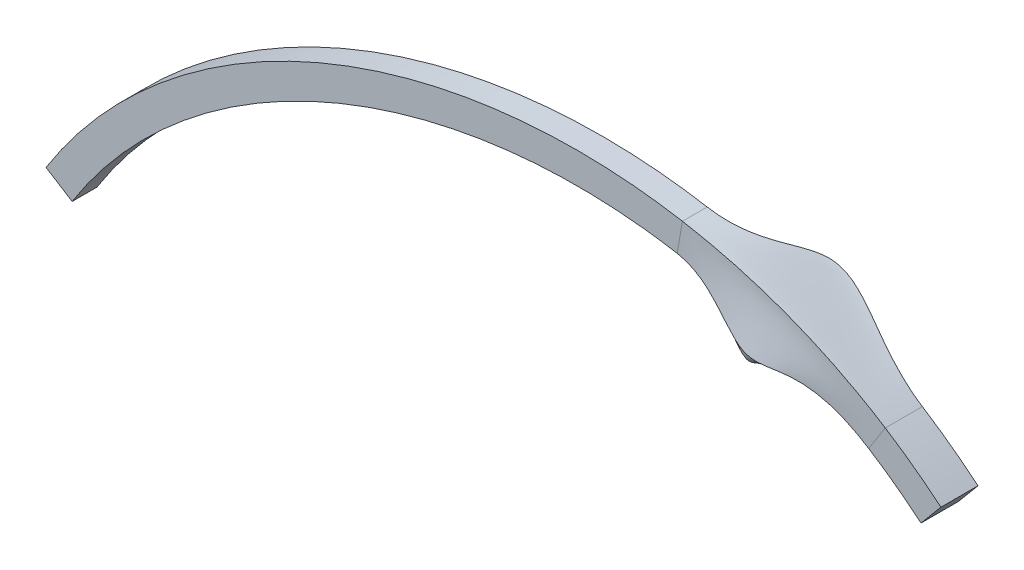
ISO-10303-21;
HEADER;
FILE_DESCRIPTION(('STEP AP214'),'2;1');
FILE_NAME('part.step','',(''),(''),'','','');
FILE_SCHEMA(('AUTOMOTIVE_DESIGN { 1 0 10303 214 1 1 1 1 }'));
ENDSEC;
DATA;
#1=APPLICATION_CONTEXT('core data for automotive mechanical design processes');
#2=APPLICATION_PROTOCOL_DEFINITION('international standard','automotive_design',2000,#1);
#3=PRODUCT_CONTEXT('',#1,'mechanical');
#4=PRODUCT('Part','Part','',(#3));
#5=PRODUCT_RELATED_PRODUCT_CATEGORY('part','',(#4));
#6=PRODUCT_DEFINITION_FORMATION('','',#4);
#7=PRODUCT_DEFINITION_CONTEXT('part definition',#1,'design');
#8=PRODUCT_DEFINITION('design','',#6,#7);
#9=PRODUCT_DEFINITION_SHAPE('','',#8);
#10=(LENGTH_UNIT() NAMED_UNIT(*) SI_UNIT(.MILLI.,.METRE.));
#11=(NAMED_UNIT(*) PLANE_ANGLE_UNIT() SI_UNIT($,.RADIAN.));
#12=(NAMED_UNIT(*) SI_UNIT($,.STERADIAN.) SOLID_ANGLE_UNIT());
#13=UNCERTAINTY_MEASURE_WITH_UNIT(LENGTH_MEASURE(1.E-05),#10,'distance_accuracy_value','');
#14=(GEOMETRIC_REPRESENTATION_CONTEXT(3) GLOBAL_UNCERTAINTY_ASSIGNED_CONTEXT((#13)) GLOBAL_UNIT_ASSIGNED_CONTEXT((#10,
#11,#12)) REPRESENTATION_CONTEXT('',''));
#15=CARTESIAN_POINT('',(0.,0.,0.));
#16=DIRECTION('',(0.,0.,1.));
#17=DIRECTION('',(1.,0.,0.));
#18=AXIS2_PLACEMENT_3D('',#15,#16,#17);
#19=CARTESIAN_POINT('',(-26.7778388272859,-42.5162456637761,-4.));
#20=DIRECTION('',(-0.532932280377656,-0.84615789574492,0.));
#21=DIRECTION('',(0.84615789574492,-0.532932280377656,0.));
#22=AXIS2_PLACEMENT_3D('',#19,#20,#21);
#23=PLANE('',#22);
#24=DIRECTION('',(0.84615789574492,-0.532932280377656,0.));
#25=VECTOR('',#24,1.);
#26=CARTESIAN_POINT('',(-26.7778388272859,-42.5162456637761,0.));
#27=LINE('',#26,#25);
#28=CARTESIAN_POINT('',(-58.4860729428837,-22.5455739972337,0.));
#29=VERTEX_POINT('',#28);
#30=CARTESIAN_POINT('',(-54.2552834641591,-25.210235399122,0.));
#31=VERTEX_POINT('',#30);
#32=EDGE_CURVE('E338',#29,#31,#27,.T.);
#33=ORIENTED_EDGE('',*,*,#32,.F.);
#34=DIRECTION('',(0.,0.,1.));
#35=VECTOR('',#34,1.);
#36=CARTESIAN_POINT('',(-58.4860729428837,-22.5455739972337,-4.));
#37=LINE('',#36,#35);
#38=CARTESIAN_POINT('',(-58.4860729428837,-22.5455739972337,-4.));
#39=VERTEX_POINT('',#38);
#40=EDGE_CURVE('E13',#39,#29,#37,.T.);
#41=ORIENTED_EDGE('',*,*,#40,.F.);
#42=DIRECTION('',(0.84615789574492,-0.532932280377656,0.));
#43=VECTOR('',#42,1.);
#44=CARTESIAN_POINT('',(-26.7778388272859,-42.5162456637761,-4.));
#45=LINE('',#44,#43);
#46=CARTESIAN_POINT('',(-54.2552834641591,-25.210235399122,-4.));
#47=VERTEX_POINT('',#46);
#48=EDGE_CURVE('E189',#39,#47,#45,.T.);
#49=ORIENTED_EDGE('',*,*,#48,.T.);
#50=DIRECTION('',(0.,0.,1.));
#51=VECTOR('',#50,1.);
#52=CARTESIAN_POINT('',(-54.2552834641591,-25.210235399122,-4.));
#53=LINE('',#52,#51);
#54=EDGE_CURVE('E176',#47,#31,#53,.T.);
#55=ORIENTED_EDGE('',*,*,#54,.T.);
#56=EDGE_LOOP('',(#33,#41,#49,#55));
#57=FACE_BOUND('',#56,.T.);
#58=ADVANCED_FACE('F133',(#57),#23,.T.);
#59=CARTESIAN_POINT('',(-58.4860729428837,-22.5455739972338,-4.));
#60=CARTESIAN_POINT('',(-29.2736847899268,23.8361029987131,-4.));
#61=CARTESIAN_POINT('',(42.4456510486213,39.122875765057,-4.));
#62=CARTESIAN_POINT('',(86.3431110128562,2.2396265560166,-4.));
#63=B_SPLINE_CURVE_WITH_KNOTS('',3,(#59,#60,#61,#62),.UNSPECIFIED.,.F.,.F.,(4,4),(0.,1.),.UNSPECIFIED.);
#64=DIRECTION('',(0.,0.,1.));
#65=VECTOR('',#64,1.);
#66=SURFACE_OF_LINEAR_EXTRUSION('',#63,#65);
#67=CARTESIAN_POINT('',(-58.4860729428837,-22.5455739972338,0.));
#68=CARTESIAN_POINT('',(-29.2736847899268,23.8361029987131,0.));
#69=CARTESIAN_POINT('',(42.4456510486213,39.122875765057,0.));
#70=CARTESIAN_POINT('',(86.3431110128562,2.2396265560166,0.));
#71=B_SPLINE_CURVE_WITH_KNOTS('',3,(#67,#68,#69,#70),.UNSPECIFIED.,.F.,.F.,(4,4),(0.,1.),.UNSPECIFIED.);
#72=CARTESIAN_POINT('',(44.5149726511451,21.4059249522048,0.));
#73=VERTEX_POINT('',#72);
#74=EDGE_CURVE('E191',#29,#73,#71,.T.);
#75=ORIENTED_EDGE('',*,*,#74,.T.);
#76=DIRECTION('',(0.,0.,1.));
#77=VECTOR('',#76,1.);
#78=CARTESIAN_POINT('',(44.5149726511451,21.4059249522048,-4.));
#79=LINE('',#78,#77);
#80=CARTESIAN_POINT('',(44.5149726511451,21.4059249522048,-4.));
#81=VERTEX_POINT('',#80);
#82=EDGE_CURVE('E143',#81,#73,#79,.T.);
#83=ORIENTED_EDGE('',*,*,#82,.F.);
#84=EDGE_CURVE('E185',#39,#81,#63,.T.);
#85=ORIENTED_EDGE('',*,*,#84,.F.);
#86=ORIENTED_EDGE('',*,*,#40,.T.);
#87=EDGE_LOOP('',(#75,#83,#85,#86));
#88=FACE_BOUND('',#87,.T.);
#89=ADVANCED_FACE('F212',(#88),#66,.F.);
#90=CARTESIAN_POINT('',(-54.2552834641591,-25.210235399122,-4.));
#91=CARTESIAN_POINT('',(-52.5404649487656,-22.4875494594722,-4.));
#92=CARTESIAN_POINT('',(-48.7789178990728,-17.2404342423249,-4.));
#93=CARTESIAN_POINT('',(-40.1273020198219,-7.70228813871967,-4.));
#94=CARTESIAN_POINT('',(-27.3895926024945,2.40516324086246,-4.));
#95=CARTESIAN_POINT('',(-9.81641949425647,11.3295034046306,-4.));
#96=CARTESIAN_POINT('',(9.2265147327727,16.7764462313085,-4.));
#97=CARTESIAN_POINT('',(26.5201441094902,18.2861193913599,-4.));
#98=CARTESIAN_POINT('',(38.7893879841258,17.3335954672545,-4.));
#99=CARTESIAN_POINT('',(45.2624194016854,16.2132540606514,-4.));
#100=CARTESIAN_POINT('',(50.7301423166898,15.0362460952299,-4.));
#101=CARTESIAN_POINT('',(57.6669546136429,13.0472161240576,-4.));
#102=CARTESIAN_POINT('',(66.0698639371278,9.57090922122011,-4.));
#103=CARTESIAN_POINT('',(72.0209516646291,6.31076727808445,-4.));
#104=CARTESIAN_POINT('',(76.191551869078,3.65320072145615,-4.));
#105=CARTESIAN_POINT('',(79.390915278317,1.42157287150065,-4.));
#106=CARTESIAN_POINT('',(81.8438130500627,-0.510619987139643,-4.));
#107=CARTESIAN_POINT('',(83.1266708688036,-1.58849475863977,-4.));
#108=B_SPLINE_CURVE_WITH_KNOTS('',3,(#90,#91,#92,#93,#94,#95,#96,#97,#98,#99,#100,#101,#102,
#103,#104,#105,#106,#107),.UNSPECIFIED.,.F.,.F.,(4,1,1,1,1,1,1,1,1,1,1,1,1,1,1,4),(0.,0.0625,
0.125,0.25,0.375,0.5,0.625,0.704656526401812,0.735906526401812,0.751531526401812,0.8125,0.875,
0.926427332772731,0.942052332772731,0.96875,1.),.UNSPECIFIED.);
#109=DIRECTION('',(0.,0.,1.));
#110=VECTOR('',#109,1.);
#111=SURFACE_OF_LINEAR_EXTRUSION('',#108,#110);
#112=CARTESIAN_POINT('',(-54.2552834641591,-25.210235399122,0.));
#113=CARTESIAN_POINT('',(-52.5404649487656,-22.4875494594722,0.));
#114=CARTESIAN_POINT('',(-48.7789178990728,-17.2404342423249,0.));
#115=CARTESIAN_POINT('',(-40.1273020198219,-7.70228813871967,0.));
#116=CARTESIAN_POINT('',(-27.3895926024945,2.40516324086246,0.));
#117=CARTESIAN_POINT('',(-9.81641949425647,11.3295034046306,0.));
#118=CARTESIAN_POINT('',(9.2265147327727,16.7764462313085,0.));
#119=CARTESIAN_POINT('',(26.5201441094902,18.2861193913599,0.));
#120=CARTESIAN_POINT('',(38.7893879841258,17.3335954672545,0.));
#121=CARTESIAN_POINT('',(45.2624194016854,16.2132540606514,0.));
#122=CARTESIAN_POINT('',(50.7301423166898,15.0362460952299,0.));
#123=CARTESIAN_POINT('',(57.6669546136429,13.0472161240576,0.));
#124=CARTESIAN_POINT('',(66.0698639371278,9.57090922122011,0.));
#125=CARTESIAN_POINT('',(72.0209516646291,6.31076727808445,0.));
#126=CARTESIAN_POINT('',(76.191551869078,3.65320072145615,0.));
#127=CARTESIAN_POINT('',(79.390915278317,1.42157287150065,0.));
#128=CARTESIAN_POINT('',(81.8438130500627,-0.510619987139643,0.));
#129=CARTESIAN_POINT('',(83.1266708688036,-1.58849475863977,0.));
#130=B_SPLINE_CURVE_WITH_KNOTS('',3,(#112,#113,#114,#115,#116,#117,#118,#119,#120,#121,#122,
#123,#124,#125,#126,#127,#128,#129),.UNSPECIFIED.,.F.,.F.,(4,1,1,1,1,1,1,1,1,1,1,1,1,1,1,4),(0.,
0.0625,0.125,0.25,0.375,0.5,0.625,0.704656526401812,0.735906526401812,0.751531526401812,0.8125,
0.875,0.926427332772731,0.942052332772731,0.96875,1.),.UNSPECIFIED.);
#131=CARTESIAN_POINT('',(43.6616217476049,16.479283881919,0.));
#132=VERTEX_POINT('',#131);
#133=EDGE_CURVE('E182',#31,#132,#130,.T.);
#134=ORIENTED_EDGE('',*,*,#133,.F.);
#135=ORIENTED_EDGE('',*,*,#54,.F.);
#136=CARTESIAN_POINT('',(43.6616217476049,16.479283881919,-4.));
#137=VERTEX_POINT('',#136);
#138=EDGE_CURVE('E179',#47,#137,#108,.T.);
#139=ORIENTED_EDGE('',*,*,#138,.T.);
#140=DIRECTION('',(0.,0.,1.));
#141=VECTOR('',#140,1.);
#142=CARTESIAN_POINT('',(43.6616217476049,16.479283881919,-4.));
#143=LINE('',#142,#141);
#144=EDGE_CURVE('E184',#137,#132,#143,.T.);
#145=ORIENTED_EDGE('',*,*,#144,.T.);
#146=EDGE_LOOP('',(#134,#135,#139,#145));
#147=FACE_BOUND('',#146,.T.);
#148=ADVANCED_FACE('F177',(#147),#111,.T.);
#149=CARTESIAN_POINT('',(0.,0.,-4.));
#150=DIRECTION('',(0.,0.,1.));
#151=DIRECTION('',(1.,0.,0.));
#152=AXIS2_PLACEMENT_3D('',#149,#150,#151);
#153=PLANE('',#152);
#154=ORIENTED_EDGE('',*,*,#48,.F.);
#155=ORIENTED_EDGE('',*,*,#84,.T.);
#156=DIRECTION('',(-0.170670180708052,-0.985328214057164,0.));
#157=VECTOR('',#156,1.);
#158=CARTESIAN_POINT('',(44.5149726511451,21.4059249522048,-4.));
#159=LINE('',#158,#157);
#160=EDGE_CURVE('E171',#137,#81,#159,.F.);
#161=ORIENTED_EDGE('',*,*,#160,.F.);
#162=ORIENTED_EDGE('',*,*,#138,.F.);
#163=EDGE_LOOP('',(#154,#155,#161,#162));
#164=FACE_BOUND('',#163,.T.);
#165=ADVANCED_FACE('F188',(#164),#153,.F.);
#166=CARTESIAN_POINT('',(0.,0.,0.));
#167=DIRECTION('',(0.,0.,1.));
#168=DIRECTION('',(1.,0.,0.));
#169=AXIS2_PLACEMENT_3D('',#166,#167,#168);
#170=PLANE('',#169);
#171=ORIENTED_EDGE('',*,*,#32,.T.);
#172=ORIENTED_EDGE('',*,*,#133,.T.);
#173=DIRECTION('',(0.170670180708052,0.985328214057164,0.));
#174=VECTOR('',#173,1.);
#175=CARTESIAN_POINT('',(43.6616217476049,16.479283881919,0.));
#176=LINE('',#175,#174);
#177=EDGE_CURVE('E194',#132,#73,#176,.T.);
#178=ORIENTED_EDGE('',*,*,#177,.T.);
#179=ORIENTED_EDGE('',*,*,#74,.F.);
#180=EDGE_LOOP('',(#171,#172,#178,#179));
#181=FACE_BOUND('',#180,.T.);
#182=ADVANCED_FACE('F216',(#181),#170,.T.);
#183=CARTESIAN_POINT('',(43.6616217476049,16.479283881919,0.));
#184=CARTESIAN_POINT('',(49.058288291364,15.5445191597641,0.));
#185=CARTESIAN_POINT('',(52.5085460777602,11.3558212466052,1.26931865153805));
#186=CARTESIAN_POINT('',(59.8071298322747,7.79358534307691,1.90232960922078));
#187=CARTESIAN_POINT('',(63.4172403695849,11.7901323316612,0.));
#188=CARTESIAN_POINT('',(74.6549375013006,4.62859361788474,0.));
#189=CARTESIAN_POINT('',(43.6616217476049,16.479283881919,-0.333333333333333));
#190=CARTESIAN_POINT('',(49.1845371388326,15.5226514071674,-0.333333333333333));
#191=CARTESIAN_POINT('',(52.5152211970674,10.9571007801769,1.06306523504773));
#192=CARTESIAN_POINT('',(59.428468267514,7.38921461571944,1.69274980743306));
#193=CARTESIAN_POINT('',(62.7395066000804,12.22203724697,-0.5));
#194=CARTESIAN_POINT('',(74.6549375013006,4.62859361788474,-0.5));
#195=CARTESIAN_POINT('',(43.6616217476049,16.479283881919,-1.));
#196=CARTESIAN_POINT('',(49.4364040611791,15.4790251590421,-1.));
#197=CARTESIAN_POINT('',(52.5285384619706,10.1616534576179,0.649784890878666));
#198=CARTESIAN_POINT('',(58.6730383729162,6.58249525328468,1.27243094157546));
#199=CARTESIAN_POINT('',(61.3874271389734,13.0836879296078,-1.5));
#200=CARTESIAN_POINT('',(74.6549375013007,4.62859361788474,-1.5));
#201=CARTESIAN_POINT('',(43.6616217476048,16.479283881919,-2.));
#202=CARTESIAN_POINT('',(49.7672232821689,15.4217234646194,-2.));
#203=CARTESIAN_POINT('',(52.5470765302183,9.12101515944585,-0.0293092312884271));
#204=CARTESIAN_POINT('',(57.6845292504128,5.5277503506173,0.553269078203259));
#205=CARTESIAN_POINT('',(59.6169009870029,14.2120055406336,-3.));
#206=CARTESIAN_POINT('',(74.6549375013006,4.62859361788474,-3.));
#207=CARTESIAN_POINT('',(43.6616217476049,16.479283881919,-3.));
#208=CARTESIAN_POINT('',(50.0042745662916,15.3806634554558,-3.));
#209=CARTESIAN_POINT('',(52.5613910728427,8.37943272643038,-0.824430031717308));
#210=CARTESIAN_POINT('',(56.9798743026702,4.77674833595714,-0.339782127494032));
#211=CARTESIAN_POINT('',(58.3535240866543,15.0171280204345,-4.5));
#212=CARTESIAN_POINT('',(74.6549375013007,4.62859361788474,-4.5));
#213=CARTESIAN_POINT('',(43.6616217476049,16.479283881919,-3.66666666666667));
#214=CARTESIAN_POINT('',(50.0691695767682,15.3694228931669,-3.66666666666667));
#215=CARTESIAN_POINT('',(52.5667418326738,8.18210665858815,-1.46976373240993));
#216=CARTESIAN_POINT('',(56.7920655887418,4.57780010253366,-1.10787967800182));
#217=CARTESIAN_POINT('',(58.0150365177277,15.2328387484055,-5.5));
#218=CARTESIAN_POINT('',(74.6549375013006,4.62859361788474,-5.5));
#219=CARTESIAN_POINT('',(43.6616217476049,16.479283881919,-4.));
#220=CARTESIAN_POINT('',(50.0703938387663,15.3692108369064,-4.));
#221=CARTESIAN_POINT('',(52.5677850138833,8.18212733439277,-1.83071938658263));
#222=CARTESIAN_POINT('',(56.7918763604993,4.57841955369139,-1.54931193622299));
#223=CARTESIAN_POINT('',(58.0135025894144,15.2338162873859,-6.));
#224=CARTESIAN_POINT('',(74.6549375013006,4.62859361788474,-6.));
#225=B_SPLINE_SURFACE_WITH_KNOTS('',3,3,((#183,#184,#185,#186,#187,#188),(#189,#190,#191,#192,
#193,#194),(#195,#196,#197,#198,#199,#200),(#201,#202,#203,#204,#205,#206),(#207,#208,#209,#210,
#211,#212),(#213,#214,#215,#216,#217,#218),(#219,#220,#221,#222,#223,#224)),.UNSPECIFIED.,.F.,
.F.,.F.,(4,1,1,1,4),(4,1,1,4),(0.505050505050505,0.628787878787879,0.752525252525252,
0.876262626262626,1.),(0.,0.400207887880467,0.414119586482785,1.),.UNSPECIFIED.);
#226=CARTESIAN_POINT('',(43.6616217476049,16.479283881919,-4.));
#227=CARTESIAN_POINT('',(50.0703938387663,15.3692108369064,-4.));
#228=CARTESIAN_POINT('',(52.5677850138833,8.18212733439277,-1.83071938658263));
#229=CARTESIAN_POINT('',(56.7918763604993,4.57841955369139,-1.54931193622299));
#230=CARTESIAN_POINT('',(58.0135025894144,15.2338162873859,-6.));
#231=CARTESIAN_POINT('',(74.6549375013006,4.62859361788474,-6.));
#232=B_SPLINE_CURVE_WITH_KNOTS('',3,(#226,#227,#228,#229,#230,#231),.UNSPECIFIED.,.F.,.F.,(4,1,
1,4),(0.,0.400207887880467,0.414119586482785,1.),.UNSPECIFIED.);
#233=CARTESIAN_POINT('',(74.6549375013006,4.62859361788474,-6.));
#234=VERTEX_POINT('',#233);
#235=EDGE_CURVE('E323',#137,#234,#232,.T.);
#236=DIRECTION('',(0.,0.,1.));
#237=VECTOR('',#236,1.);
#238=CARTESIAN_POINT('',(74.6549375013006,4.62859361788474,-6.));
#239=LINE('',#238,#237);
#240=CARTESIAN_POINT('',(74.6549375013006,4.62859361788474,0.));
#241=VERTEX_POINT('',#240);
#242=EDGE_CURVE('E333',#234,#241,#239,.T.);
#243=CARTESIAN_POINT('',(43.6616217476049,16.479283881919,0.));
#244=CARTESIAN_POINT('',(49.058288291364,15.5445191597641,0.));
#245=CARTESIAN_POINT('',(52.5085460777602,11.3558212466052,1.26931865153805));
#246=CARTESIAN_POINT('',(59.8071298322747,7.79358534307691,1.90232960922078));
#247=CARTESIAN_POINT('',(63.4172403695849,11.7901323316612,0.));
#248=CARTESIAN_POINT('',(74.6549375013006,4.62859361788474,0.));
#249=B_SPLINE_CURVE_WITH_KNOTS('',3,(#243,#244,#245,#246,#247,#248),.UNSPECIFIED.,.F.,.F.,(4,1,
1,4),(0.,0.400207887880467,0.414119586482785,1.),.UNSPECIFIED.);
#250=EDGE_CURVE('E339',#132,#241,#249,.T.);
#251=ORIENTED_EDGE('',*,*,#144,.F.);
#252=ORIENTED_EDGE('',*,*,#235,.T.);
#253=ORIENTED_EDGE('',*,*,#242,.T.);
#254=ORIENTED_EDGE('',*,*,#250,.F.);
#255=EDGE_LOOP('',(#251,#252,#253,#254));
#256=FACE_BOUND('',#255,.T.);
#257=ADVANCED_FACE('F219',(#256),#225,.T.);
#258=CARTESIAN_POINT('',(44.5149726511451,21.4059249522048,0.));
#259=CARTESIAN_POINT('',(49.1350308517061,20.6056777282623,0.));
#260=CARTESIAN_POINT('',(53.8319527621497,19.4406235327352,0.));
#261=CARTESIAN_POINT('',(64.9166668930451,15.7086761608647,0.));
#262=CARTESIAN_POINT('',(71.3402812230721,12.6699553681136,0.));
#263=CARTESIAN_POINT('',(77.3420589978219,8.84515359764709,0.));
#264=CARTESIAN_POINT('',(44.4438600758501,20.995371529681,0.));
#265=CARTESIAN_POINT('',(49.0423783753365,20.1988552643738,0.));
#266=CARTESIAN_POINT('',(53.717159756172,19.03951337998,0.));
#267=CARTESIAN_POINT('',(64.7497693210496,15.3256034967574,0.));
#268=CARTESIAN_POINT('',(71.1433426614815,12.3013763609494,0.));
#269=CARTESIAN_POINT('',(77.1181322064451,8.49377359933356,0.));
#270=CARTESIAN_POINT('',(44.3016349252601,20.1742646846333,0.));
#271=CARTESIAN_POINT('',(48.9220947537935,19.3739478941062,0.));
#272=CARTESIAN_POINT('',(53.4909727419388,18.0317876398053,0.0797351183390017));
#273=CARTESIAN_POINT('',(64.2208156416118,14.3510167527381,0.119499131543691));
#274=CARTESIAN_POINT('',(70.4002155254928,11.7867877447985,0.));
#275=CARTESIAN_POINT('',(76.6702786236915,7.7910136027065,0.));
#276=CARTESIAN_POINT('',(44.0882971993749,18.9426044170619,0.));
#277=CARTESIAN_POINT('',(48.887474750069,18.1113316613023,0.));
#278=CARTESIAN_POINT('',(53.1593142318763,16.0593686612273,0.378137758183448));
#279=CARTESIAN_POINT('',(62.9897568884783,12.421722562519,0.566715578381444));
#280=CARTESIAN_POINT('',(68.5023581020152,11.5139998500309,0.));
#281=CARTESIAN_POINT('',(75.9984982495613,6.73687360776593,0.));
#282=CARTESIAN_POINT('',(43.87495947349,17.7109441494904,0.));
#283=CARTESIAN_POINT('',(48.9494015849221,16.8319924054978,0.));
#284=CARTESIAN_POINT('',(52.8327027299077,13.7818052495875,0.794934967682775));
#285=CARTESIAN_POINT('',(61.4689172775992,10.182924458677,1.19137012963256));
#286=CARTESIAN_POINT('',(66.0859173093121,11.5716937996748,0.));
#287=CARTESIAN_POINT('',(75.3267178754309,5.68273361282533,0.));
#288=CARTESIAN_POINT('',(43.7327343228999,16.8898373044428,0.));
#289=CARTESIAN_POINT('',(49.022211649591,15.9736389876603,0.));
#290=CARTESIAN_POINT('',(52.6166097395795,12.1637906434422,1.11145922533154));
#291=CARTESIAN_POINT('',(60.3604018812703,8.58932989199478,1.66574547000297));
#292=CARTESIAN_POINT('',(64.305623423525,11.7180688795788,0.));
#293=CARTESIAN_POINT('',(74.8788642926774,4.97997361619827,0.));
#294=CARTESIAN_POINT('',(43.6616217476049,16.479283881919,0.));
#295=CARTESIAN_POINT('',(49.058288291364,15.5445191597641,0.));
#296=CARTESIAN_POINT('',(52.5085460777602,11.3558212466052,1.26931865153805));
#297=CARTESIAN_POINT('',(59.8071298322747,7.79358534307691,1.90232960922078));
#298=CARTESIAN_POINT('',(63.4172403695849,11.7901323316612,0.));
#299=CARTESIAN_POINT('',(74.6549375013006,4.62859361788474,0.));
#300=B_SPLINE_SURFACE_WITH_KNOTS('',3,3,((#258,#259,#260,#261,#262,#263),(#264,#265,#266,#267,
#268,#269),(#270,#271,#272,#273,#274,#275),(#276,#277,#278,#279,#280,#281),(#282,#283,#284,#285,
#286,#287),(#288,#289,#290,#291,#292,#293),(#294,#295,#296,#297,#298,#299)),.UNSPECIFIED.,.F.,
.F.,.F.,(4,1,1,1,4),(4,1,1,4),(0.,0.126262626262626,0.252525252525252,0.378787878787879,
0.505050505050505),(0.,0.400207887880467,0.414119586482785,1.),.UNSPECIFIED.);
#301=DIRECTION('',(0.537424299304246,0.843311995952471,0.));
#302=VECTOR('',#301,1.);
#303=CARTESIAN_POINT('',(50.994979979447,-32.4979859352468,0.));
#304=LINE('',#303,#302);
#305=CARTESIAN_POINT('',(77.3420589978219,8.84515359764709,0.));
#306=VERTEX_POINT('',#305);
#307=EDGE_CURVE('E136',#241,#306,#304,.T.);
#308=CARTESIAN_POINT('',(44.5149726511451,21.4059249522048,0.));
#309=CARTESIAN_POINT('',(49.1350308517061,20.6056777282623,0.));
#310=CARTESIAN_POINT('',(53.8319527621497,19.4406235327352,0.));
#311=CARTESIAN_POINT('',(64.9166668930451,15.7086761608647,0.));
#312=CARTESIAN_POINT('',(71.3402812230721,12.6699553681136,0.));
#313=CARTESIAN_POINT('',(77.3420589978219,8.84515359764709,0.));
#314=B_SPLINE_CURVE_WITH_KNOTS('',3,(#308,#309,#310,#311,#312,#313),.UNSPECIFIED.,.F.,.F.,(4,1,
1,4),(0.,0.400207887880467,0.414119586482785,1.),.UNSPECIFIED.);
#315=EDGE_CURVE('E445',#73,#306,#314,.T.);
#316=ORIENTED_EDGE('',*,*,#177,.F.);
#317=ORIENTED_EDGE('',*,*,#250,.T.);
#318=ORIENTED_EDGE('',*,*,#307,.T.);
#319=ORIENTED_EDGE('',*,*,#315,.F.);
#320=EDGE_LOOP('',(#316,#317,#318,#319));
#321=FACE_BOUND('',#320,.T.);
#322=ADVANCED_FACE('F266',(#321),#300,.T.);
#323=CARTESIAN_POINT('',(43.6616217476049,16.479283881919,-4.));
#324=CARTESIAN_POINT('',(50.0703938387663,15.3692108369064,-4.));
#325=CARTESIAN_POINT('',(52.5677850138833,8.18212733439277,-1.83071938658263));
#326=CARTESIAN_POINT('',(56.7918763604993,4.57841955369139,-1.54931193622299));
#327=CARTESIAN_POINT('',(58.0135025894144,15.2338162873859,-6.));
#328=CARTESIAN_POINT('',(74.6549375013006,4.62859361788474,-6.));
#329=CARTESIAN_POINT('',(43.946072048785,18.1214975720143,-4.));
#330=CARTESIAN_POINT('',(50.4408563364898,16.9965262251793,-4.));
#331=CARTESIAN_POINT('',(53.026831433144,9.78656545593522,-1.83071938658263));
#332=CARTESIAN_POINT('',(57.459489432583,6.1106356248565,-1.54931193622299));
#333=CARTESIAN_POINT('',(58.8014415290278,16.7080146150719,-6.));
#334=CARTESIAN_POINT('',(75.5506446668077,6.03411361113886,-6.));
#335=CARTESIAN_POINT('',(44.230522349965,19.7637112621095,-4.));
#336=CARTESIAN_POINT('',(51.9819675890122,18.4210717833825,-4.));
#337=CARTESIAN_POINT('',(53.7153912187965,16.9603145198517,-9.55679628402011));
#338=CARTESIAN_POINT('',(61.3205922499985,13.8747474752707,-12.6897801649369));
#339=CARTESIAN_POINT('',(68.7923473266031,12.3173633510305,-6.));
#340=CARTESIAN_POINT('',(76.4463518323148,7.43963360439298,-6.));
#341=CARTESIAN_POINT('',(44.5149726511451,21.4059249522048,-4.));
#342=CARTESIAN_POINT('',(52.3524300867357,20.0483871716553,-4.));
#343=CARTESIAN_POINT('',(54.1744376380573,18.5647526413942,-9.55679628402011));
#344=CARTESIAN_POINT('',(61.9882053220822,15.4069635464358,-12.6897801649369));
#345=CARTESIAN_POINT('',(69.5802862662164,13.7915616787163,-5.99999999999999));
#346=CARTESIAN_POINT('',(77.3420589978219,8.84515359764709,-6.));
#347=B_SPLINE_SURFACE_WITH_KNOTS('',3,3,((#323,#324,#325,#326,#327,#328),(#329,#330,#331,#332,
#333,#334),(#335,#336,#337,#338,#339,#340),(#341,#342,#343,#344,#345,#346)),.UNSPECIFIED.,.F.,
.F.,.F.,(4,4),(4,1,1,4),(0.,1.),(0.,0.400207887880467,0.414119586482785,1.),.UNSPECIFIED.);
#348=CARTESIAN_POINT('',(44.5149726511451,21.4059249522048,-4.));
#349=CARTESIAN_POINT('',(52.3524300867357,20.0483871716553,-4.));
#350=CARTESIAN_POINT('',(54.1744376380573,18.5647526413942,-9.55679628402011));
#351=CARTESIAN_POINT('',(61.9882053220822,15.4069635464358,-12.6897801649369));
#352=CARTESIAN_POINT('',(69.5802862662164,13.7915616787163,-5.99999999999999));
#353=CARTESIAN_POINT('',(77.3420589978219,8.84515359764709,-6.));
#354=B_SPLINE_CURVE_WITH_KNOTS('',3,(#348,#349,#350,#351,#352,#353),.UNSPECIFIED.,.F.,.F.,(4,1,
1,4),(0.,0.400207887880467,0.414119586482785,1.),.UNSPECIFIED.);
#355=CARTESIAN_POINT('',(77.3420589978219,8.84515359764709,-6.));
#356=VERTEX_POINT('',#355);
#357=EDGE_CURVE('E326',#81,#356,#354,.T.);
#358=DIRECTION('',(0.537424299304246,0.843311995952471,0.));
#359=VECTOR('',#358,1.);
#360=CARTESIAN_POINT('',(50.994979979447,-32.4979859352468,-6.));
#361=LINE('',#360,#359);
#362=EDGE_CURVE('E314',#234,#356,#361,.T.);
#363=ORIENTED_EDGE('',*,*,#160,.T.);
#364=ORIENTED_EDGE('',*,*,#357,.T.);
#365=ORIENTED_EDGE('',*,*,#362,.F.);
#366=ORIENTED_EDGE('',*,*,#235,.F.);
#367=EDGE_LOOP('',(#363,#364,#365,#366));
#368=FACE_BOUND('',#367,.T.);
#369=ADVANCED_FACE('F230',(#368),#347,.T.);
#370=CARTESIAN_POINT('',(44.5149726511451,21.4059249522048,-4.));
#371=CARTESIAN_POINT('',(52.3524300867357,20.0483871716553,-4.));
#372=CARTESIAN_POINT('',(54.1744376380573,18.5647526413942,-9.55679628402011));
#373=CARTESIAN_POINT('',(61.9882053220822,15.4069635464358,-12.6897801649369));
#374=CARTESIAN_POINT('',(69.5802862662164,13.7915616787163,-5.99999999999999));
#375=CARTESIAN_POINT('',(77.3420589978219,8.84515359764709,-6.));
#376=CARTESIAN_POINT('',(44.5149726511451,21.4059249522048,-2.66666666666667));
#377=CARTESIAN_POINT('',(52.349938931514,20.048818668395,-2.66666666666667));
#378=CARTESIAN_POINT('',(54.1723149500042,18.5647105698125,-8.1129736673293));
#379=CARTESIAN_POINT('',(61.9885903678691,15.4057030736051,-10.9240511320522));
#380=CARTESIAN_POINT('',(69.5834075372623,13.789572560913,-4.));
#381=CARTESIAN_POINT('',(77.3420589978219,8.84515359764709,-4.));
#382=CARTESIAN_POINT('',(44.5149726511451,21.4059249522048,-1.33333333333333));
#383=CARTESIAN_POINT('',(49.1375220069278,20.6052462315226,-1.33333333333333));
#384=CARTESIAN_POINT('',(53.8340754502028,19.4406656043169,-1.44382261669081));
#385=CARTESIAN_POINT('',(64.9162818472582,15.7099366336954,-1.7657290328847));
#386=CARTESIAN_POINT('',(71.3371599520262,12.6719444859168,-2.));
#387=CARTESIAN_POINT('',(77.3420589978219,8.84515359764709,-2.));
#388=CARTESIAN_POINT('',(44.5149726511451,21.4059249522048,0.));
#389=CARTESIAN_POINT('',(49.1350308517061,20.6056777282623,0.));
#390=CARTESIAN_POINT('',(53.8319527621497,19.4406235327352,0.));
#391=CARTESIAN_POINT('',(64.9166668930451,15.7086761608647,0.));
#392=CARTESIAN_POINT('',(71.3402812230721,12.6699553681136,0.));
#393=CARTESIAN_POINT('',(77.3420589978219,8.84515359764709,0.));
#394=B_SPLINE_SURFACE_WITH_KNOTS('',3,3,((#370,#371,#372,#373,#374,#375),(#376,#377,#378,#379,
#380,#381),(#382,#383,#384,#385,#386,#387),(#388,#389,#390,#391,#392,#393)),.UNSPECIFIED.,.F.,
.F.,.F.,(4,4),(4,1,1,4),(0.,1.),(0.,0.400207887880467,0.414119586482785,1.),.UNSPECIFIED.);
#395=DIRECTION('',(0.,0.,1.));
#396=VECTOR('',#395,1.);
#397=CARTESIAN_POINT('',(77.3420589978219,8.84515359764709,-6.));
#398=LINE('',#397,#396);
#399=EDGE_CURVE('E334',#356,#306,#398,.T.);
#400=ORIENTED_EDGE('',*,*,#82,.T.);
#401=ORIENTED_EDGE('',*,*,#315,.T.);
#402=ORIENTED_EDGE('',*,*,#399,.F.);
#403=ORIENTED_EDGE('',*,*,#357,.F.);
#404=EDGE_LOOP('',(#400,#401,#402,#403));
#405=FACE_BOUND('',#404,.T.);
#406=ADVANCED_FACE('F223',(#405),#394,.T.);
#407=CARTESIAN_POINT('',(-58.4860729428837,-22.5455739972338,-6.));
#408=CARTESIAN_POINT('',(-29.2736847899268,23.8361029987131,-6.));
#409=CARTESIAN_POINT('',(42.4456510486213,39.122875765057,-6.));
#410=CARTESIAN_POINT('',(86.3431110128562,2.2396265560166,-6.));
#411=B_SPLINE_CURVE_WITH_KNOTS('',3,(#407,#408,#409,#410),.UNSPECIFIED.,.F.,.F.,(4,4),(0.,1.),.UNSPECIFIED.);
#412=DIRECTION('',(0.,0.,1.));
#413=VECTOR('',#412,1.);
#414=SURFACE_OF_LINEAR_EXTRUSION('',#411,#413);
#415=CARTESIAN_POINT('',(-58.4860729428837,-22.5455739972338,0.));
#416=CARTESIAN_POINT('',(-29.2736847899268,23.8361029987131,0.));
#417=CARTESIAN_POINT('',(42.4456510486213,39.122875765057,0.));
#418=CARTESIAN_POINT('',(86.3431110128562,2.2396265560166,0.));
#419=B_SPLINE_CURVE_WITH_KNOTS('',3,(#415,#416,#417,#418),.UNSPECIFIED.,.F.,.F.,(4,4),(0.,1.),.UNSPECIFIED.);
#420=CARTESIAN_POINT('',(86.3431110128562,2.2396265560166,0.));
#421=VERTEX_POINT('',#420);
#422=EDGE_CURVE('E358',#306,#421,#419,.T.);
#423=ORIENTED_EDGE('',*,*,#422,.T.);
#424=DIRECTION('',(0.,0.,1.));
#425=VECTOR('',#424,1.);
#426=CARTESIAN_POINT('',(86.3431110128562,2.2396265560166,-6.));
#427=LINE('',#426,#425);
#428=CARTESIAN_POINT('',(86.3431110128562,2.2396265560166,-6.));
#429=VERTEX_POINT('',#428);
#430=EDGE_CURVE('E434',#429,#421,#427,.T.);
#431=ORIENTED_EDGE('',*,*,#430,.F.);
#432=EDGE_CURVE('E359',#356,#429,#411,.T.);
#433=ORIENTED_EDGE('',*,*,#432,.F.);
#434=ORIENTED_EDGE('',*,*,#399,.T.);
#435=EDGE_LOOP('',(#423,#431,#433,#434));
#436=FACE_BOUND('',#435,.T.);
#437=ADVANCED_FACE('F229',(#436),#414,.F.);
#438=CARTESIAN_POINT('',(49.5095950404059,-41.5986422358319,-6.));
#439=DIRECTION('',(-0.765624262931274,0.643288028810534,0.));
#440=DIRECTION('',(-0.643288028810535,-0.765624262931274,0.));
#441=AXIS2_PLACEMENT_3D('',#438,#439,#440);
#442=PLANE('',#441);
#443=DIRECTION('',(-0.643288028810535,-0.765624262931274,0.));
#444=VECTOR('',#443,1.);
#445=CARTESIAN_POINT('',(49.5095950404059,-41.5986422358319,0.));
#446=LINE('',#445,#444);
#447=CARTESIAN_POINT('',(83.1266708688036,-1.58849475863976,0.));
#448=VERTEX_POINT('',#447);
#449=EDGE_CURVE('E362',#421,#448,#446,.T.);
#450=ORIENTED_EDGE('',*,*,#449,.T.);
#451=DIRECTION('',(0.,0.,1.));
#452=VECTOR('',#451,1.);
#453=CARTESIAN_POINT('',(83.1266708688036,-1.58849475863976,-6.));
#454=LINE('',#453,#452);
#455=CARTESIAN_POINT('',(83.1266708688036,-1.58849475863976,-6.));
#456=VERTEX_POINT('',#455);
#457=EDGE_CURVE('E387',#456,#448,#454,.T.);
#458=ORIENTED_EDGE('',*,*,#457,.F.);
#459=DIRECTION('',(-0.643288028810535,-0.765624262931274,0.));
#460=VECTOR('',#459,1.);
#461=CARTESIAN_POINT('',(49.5095950404059,-41.5986422358319,-6.));
#462=LINE('',#461,#460);
#463=EDGE_CURVE('E356',#429,#456,#462,.T.);
#464=ORIENTED_EDGE('',*,*,#463,.F.);
#465=ORIENTED_EDGE('',*,*,#430,.T.);
#466=EDGE_LOOP('',(#450,#458,#464,#465));
#467=FACE_BOUND('',#466,.T.);
#468=ADVANCED_FACE('F431',(#467),#442,.F.);
#469=CARTESIAN_POINT('',(-54.2552834641591,-25.210235399122,-6.));
#470=CARTESIAN_POINT('',(-52.5404649487656,-22.4875494594722,-6.));
#471=CARTESIAN_POINT('',(-48.7789178990728,-17.2404342423249,-6.));
#472=CARTESIAN_POINT('',(-40.1273020198219,-7.70228813871967,-6.));
#473=CARTESIAN_POINT('',(-27.3895926024945,2.40516324086246,-6.));
#474=CARTESIAN_POINT('',(-9.81641949425647,11.3295034046306,-6.));
#475=CARTESIAN_POINT('',(9.2265147327727,16.7764462313085,-6.));
#476=CARTESIAN_POINT('',(26.5201441094902,18.2861193913599,-6.));
#477=CARTESIAN_POINT('',(38.7893879841258,17.3335954672545,-6.));
#478=CARTESIAN_POINT('',(45.2624194016854,16.2132540606514,-6.));
#479=CARTESIAN_POINT('',(50.7301423166898,15.0362460952299,-6.));
#480=CARTESIAN_POINT('',(57.6669546136429,13.0472161240576,-6.));
#481=CARTESIAN_POINT('',(66.0698639371278,9.57090922122011,-6.));
#482=CARTESIAN_POINT('',(72.0209516646291,6.31076727808445,-6.));
#483=CARTESIAN_POINT('',(76.191551869078,3.65320072145615,-6.));
#484=CARTESIAN_POINT('',(79.390915278317,1.42157287150065,-6.));
#485=CARTESIAN_POINT('',(81.8438130500627,-0.510619987139643,-6.));
#486=CARTESIAN_POINT('',(83.1266708688036,-1.58849475863977,-6.));
#487=B_SPLINE_CURVE_WITH_KNOTS('',3,(#469,#470,#471,#472,#473,#474,#475,#476,#477,#478,#479,
#480,#481,#482,#483,#484,#485,#486),.UNSPECIFIED.,.F.,.F.,(4,1,1,1,1,1,1,1,1,1,1,1,1,1,1,4),(0.,
0.0625,0.125,0.25,0.375,0.5,0.625,0.704656526401812,0.735906526401812,0.751531526401812,0.8125,
0.875,0.926427332772731,0.942052332772731,0.96875,1.),.UNSPECIFIED.);
#488=DIRECTION('',(0.,0.,1.));
#489=VECTOR('',#488,1.);
#490=SURFACE_OF_LINEAR_EXTRUSION('',#487,#489);
#491=CARTESIAN_POINT('',(-54.2552834641591,-25.210235399122,0.));
#492=CARTESIAN_POINT('',(-52.5404649487656,-22.4875494594722,0.));
#493=CARTESIAN_POINT('',(-48.7789178990728,-17.2404342423249,0.));
#494=CARTESIAN_POINT('',(-40.1273020198219,-7.70228813871967,0.));
#495=CARTESIAN_POINT('',(-27.3895926024945,2.40516324086246,0.));
#496=CARTESIAN_POINT('',(-9.81641949425647,11.3295034046306,0.));
#497=CARTESIAN_POINT('',(9.2265147327727,16.7764462313085,0.));
#498=CARTESIAN_POINT('',(26.5201441094902,18.2861193913599,0.));
#499=CARTESIAN_POINT('',(38.7893879841258,17.3335954672545,0.));
#500=CARTESIAN_POINT('',(45.2624194016854,16.2132540606514,0.));
#501=CARTESIAN_POINT('',(50.7301423166898,15.0362460952299,0.));
#502=CARTESIAN_POINT('',(57.6669546136429,13.0472161240576,0.));
#503=CARTESIAN_POINT('',(66.0698639371278,9.57090922122011,0.));
#504=CARTESIAN_POINT('',(72.0209516646291,6.31076727808445,0.));
#505=CARTESIAN_POINT('',(76.191551869078,3.65320072145615,0.));
#506=CARTESIAN_POINT('',(79.390915278317,1.42157287150065,0.));
#507=CARTESIAN_POINT('',(81.8438130500627,-0.510619987139643,0.));
#508=CARTESIAN_POINT('',(83.1266708688036,-1.58849475863977,0.));
#509=B_SPLINE_CURVE_WITH_KNOTS('',3,(#491,#492,#493,#494,#495,#496,#497,#498,#499,#500,#501,
#502,#503,#504,#505,#506,#507,#508),.UNSPECIFIED.,.F.,.F.,(4,1,1,1,1,1,1,1,1,1,1,1,1,1,1,4),(0.,
0.0625,0.125,0.25,0.375,0.5,0.625,0.704656526401812,0.735906526401812,0.751531526401812,0.8125,
0.875,0.926427332772731,0.942052332772731,0.96875,1.),.UNSPECIFIED.);
#510=EDGE_CURVE('E349',#241,#448,#509,.T.);
#511=ORIENTED_EDGE('',*,*,#510,.F.);
#512=ORIENTED_EDGE('',*,*,#242,.F.);
#513=EDGE_CURVE('E347',#234,#456,#487,.T.);
#514=ORIENTED_EDGE('',*,*,#513,.T.);
#515=ORIENTED_EDGE('',*,*,#457,.T.);
#516=EDGE_LOOP('',(#511,#512,#514,#515));
#517=FACE_BOUND('',#516,.T.);
#518=ADVANCED_FACE('F277',(#517),#490,.T.);
#519=CARTESIAN_POINT('',(0.,0.,-6.));
#520=DIRECTION('',(0.,0.,1.));
#521=DIRECTION('',(1.,0.,0.));
#522=AXIS2_PLACEMENT_3D('',#519,#520,#521);
#523=PLANE('',#522);
#524=ORIENTED_EDGE('',*,*,#362,.T.);
#525=ORIENTED_EDGE('',*,*,#432,.T.);
#526=ORIENTED_EDGE('',*,*,#463,.T.);
#527=ORIENTED_EDGE('',*,*,#513,.F.);
#528=EDGE_LOOP('',(#524,#525,#526,#527));
#529=FACE_BOUND('',#528,.T.);
#530=ADVANCED_FACE('F354',(#529),#523,.F.);
#531=CARTESIAN_POINT('',(0.,0.,0.));
#532=DIRECTION('',(0.,0.,1.));
#533=DIRECTION('',(1.,0.,0.));
#534=AXIS2_PLACEMENT_3D('',#531,#532,#533);
#535=PLANE('',#534);
#536=ORIENTED_EDGE('',*,*,#307,.F.);
#537=ORIENTED_EDGE('',*,*,#510,.T.);
#538=ORIENTED_EDGE('',*,*,#449,.F.);
#539=ORIENTED_EDGE('',*,*,#422,.F.);
#540=EDGE_LOOP('',(#536,#537,#538,#539));
#541=FACE_BOUND('',#540,.T.);
#542=ADVANCED_FACE('F399',(#541),#535,.T.);
#543=CLOSED_SHELL('',(#58,#89,#148,#165,#182,#257,#322,#369,#406,#437,#468,#518,#530,#542));
#544=MANIFOLD_SOLID_BREP('B2',#543);
#545=ADVANCED_BREP_SHAPE_REPRESENTATION('',(#18,#544),#14);
#546=SHAPE_DEFINITION_REPRESENTATION(#9,#545);
ENDSEC;
END-ISO-10303-21;
